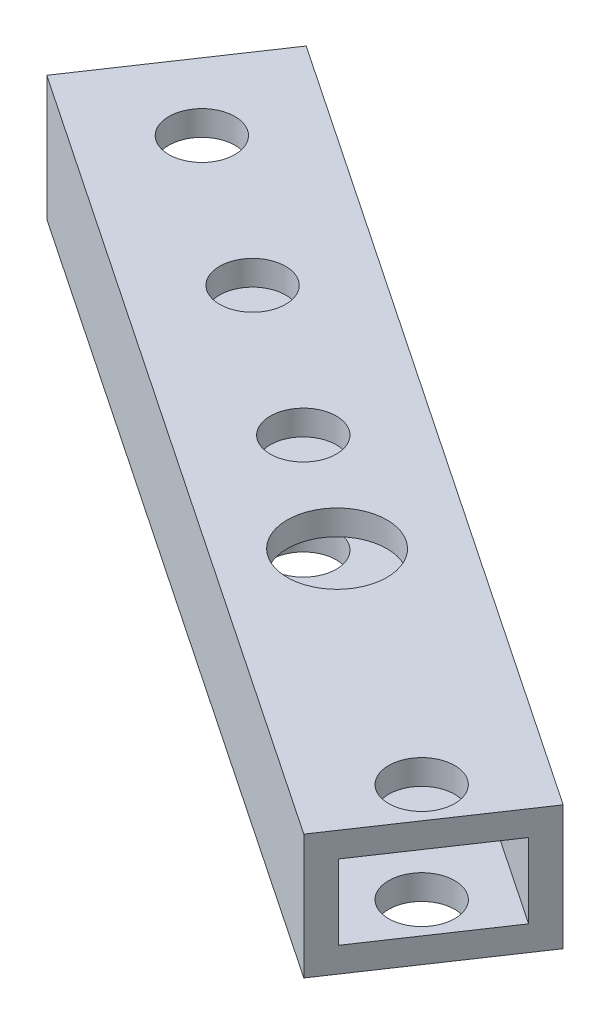
ISO-10303-21;
HEADER;
FILE_DESCRIPTION(('STEP AP214'),'2;1');
FILE_NAME('part.step','',(''),(''),'','','');
FILE_SCHEMA(('AUTOMOTIVE_DESIGN { 1 0 10303 214 1 1 1 1 }'));
ENDSEC;
DATA;
#1=APPLICATION_CONTEXT('core data for automotive mechanical design processes');
#2=APPLICATION_PROTOCOL_DEFINITION('international standard','automotive_design',2000,#1);
#3=PRODUCT_CONTEXT('',#1,'mechanical');
#4=PRODUCT('Part','Part','',(#3));
#5=PRODUCT_RELATED_PRODUCT_CATEGORY('part','',(#4));
#6=PRODUCT_DEFINITION_FORMATION('','',#4);
#7=PRODUCT_DEFINITION_CONTEXT('part definition',#1,'design');
#8=PRODUCT_DEFINITION('design','',#6,#7);
#9=PRODUCT_DEFINITION_SHAPE('','',#8);
#10=(LENGTH_UNIT() NAMED_UNIT(*) SI_UNIT(.MILLI.,.METRE.));
#11=(NAMED_UNIT(*) PLANE_ANGLE_UNIT() SI_UNIT($,.RADIAN.));
#12=(NAMED_UNIT(*) SI_UNIT($,.STERADIAN.) SOLID_ANGLE_UNIT());
#13=UNCERTAINTY_MEASURE_WITH_UNIT(LENGTH_MEASURE(1.E-05),#10,'distance_accuracy_value','');
#14=(GEOMETRIC_REPRESENTATION_CONTEXT(3) GLOBAL_UNCERTAINTY_ASSIGNED_CONTEXT((#13)) GLOBAL_UNIT_ASSIGNED_CONTEXT((#10,
#11,#12)) REPRESENTATION_CONTEXT('',''));
#15=CARTESIAN_POINT('',(0.,0.,0.));
#16=DIRECTION('',(0.,0.,1.));
#17=DIRECTION('',(1.,0.,0.));
#18=AXIS2_PLACEMENT_3D('',#15,#16,#17);
#19=CARTESIAN_POINT('',(-56.7499214691754,0.,-212.039127339994));
#20=DIRECTION('',(0.,1.,0.));
#21=DIRECTION('',(0.,0.,1.));
#22=AXIS2_PLACEMENT_3D('',#19,#20,#21);
#23=CYLINDRICAL_SURFACE('',#22,2.65);
#24=CARTESIAN_POINT('',(-56.7499214691754,12.,-212.039127339994));
#25=DIRECTION('',(0.,-1.,0.));
#26=DIRECTION('',(0.,0.,-1.));
#27=AXIS2_PLACEMENT_3D('',#24,#25,#26);
#28=CIRCLE('',#27,2.65);
#29=CARTESIAN_POINT('',(-56.7499214691754,12.,-214.689127339994));
#30=VERTEX_POINT('',#29);
#31=EDGE_CURVE('E183',#30,#30,#28,.F.);
#32=ORIENTED_EDGE('',*,*,#31,.T.);
#33=EDGE_LOOP('',(#32));
#34=FACE_BOUND('',#33,.T.);
#35=CARTESIAN_POINT('',(-56.7499214691754,10.,-212.039127339994));
#36=DIRECTION('',(0.,1.,0.));
#37=DIRECTION('',(0.,0.,1.));
#38=AXIS2_PLACEMENT_3D('',#35,#36,#37);
#39=CIRCLE('',#38,2.65);
#40=CARTESIAN_POINT('',(-56.7499214691754,10.,-209.389127339994));
#41=VERTEX_POINT('',#40);
#42=EDGE_CURVE('E136',#41,#41,#39,.T.);
#43=ORIENTED_EDGE('',*,*,#42,.F.);
#44=EDGE_LOOP('',(#43));
#45=FACE_BOUND('',#44,.T.);
#46=ADVANCED_FACE('F37',(#34,#45),#23,.F.);
#47=CARTESIAN_POINT('',(-69.1949044966264,0.,-220.413039057134));
#48=DIRECTION('',(0.,1.,0.));
#49=DIRECTION('',(0.,0.,1.));
#50=AXIS2_PLACEMENT_3D('',#47,#48,#49);
#51=CYLINDRICAL_SURFACE('',#50,2.65);
#52=CARTESIAN_POINT('',(-69.1949044966264,12.,-220.413039057134));
#53=DIRECTION('',(0.,-1.,0.));
#54=DIRECTION('',(0.,0.,-1.));
#55=AXIS2_PLACEMENT_3D('',#52,#53,#54);
#56=CIRCLE('',#55,2.65);
#57=CARTESIAN_POINT('',(-69.1949044966264,12.,-223.063039057134));
#58=VERTEX_POINT('',#57);
#59=EDGE_CURVE('E186',#58,#58,#56,.F.);
#60=ORIENTED_EDGE('',*,*,#59,.T.);
#61=EDGE_LOOP('',(#60));
#62=FACE_BOUND('',#61,.T.);
#63=CARTESIAN_POINT('',(-69.1949044966264,10.,-220.413039057134));
#64=DIRECTION('',(0.,1.,0.));
#65=DIRECTION('',(0.,0.,1.));
#66=AXIS2_PLACEMENT_3D('',#63,#64,#65);
#67=CIRCLE('',#66,2.65);
#68=CARTESIAN_POINT('',(-69.1949044966264,10.,-217.763039057134));
#69=VERTEX_POINT('',#68);
#70=EDGE_CURVE('E133',#69,#69,#67,.T.);
#71=ORIENTED_EDGE('',*,*,#70,.F.);
#72=EDGE_LOOP('',(#71));
#73=FACE_BOUND('',#72,.T.);
#74=ADVANCED_FACE('F246',(#62,#73),#51,.F.);
#75=CARTESIAN_POINT('',(-81.6398875240773,0.,-228.786950774274));
#76=DIRECTION('',(0.,1.,0.));
#77=DIRECTION('',(0.,0.,1.));
#78=AXIS2_PLACEMENT_3D('',#75,#76,#77);
#79=CYLINDRICAL_SURFACE('',#78,2.65);
#80=CARTESIAN_POINT('',(-81.6398875240773,12.,-228.786950774274));
#81=DIRECTION('',(0.,-1.,0.));
#82=DIRECTION('',(0.,0.,-1.));
#83=AXIS2_PLACEMENT_3D('',#80,#81,#82);
#84=CIRCLE('',#83,2.65);
#85=CARTESIAN_POINT('',(-81.6398875240773,12.,-231.436950774274));
#86=VERTEX_POINT('',#85);
#87=EDGE_CURVE('E189',#86,#86,#84,.F.);
#88=ORIENTED_EDGE('',*,*,#87,.T.);
#89=EDGE_LOOP('',(#88));
#90=FACE_BOUND('',#89,.T.);
#91=CARTESIAN_POINT('',(-81.6398875240773,10.,-228.786950774274));
#92=DIRECTION('',(0.,1.,0.));
#93=DIRECTION('',(0.,0.,1.));
#94=AXIS2_PLACEMENT_3D('',#91,#92,#93);
#95=CIRCLE('',#94,2.65);
#96=CARTESIAN_POINT('',(-81.6398875240773,10.,-226.136950774274));
#97=VERTEX_POINT('',#96);
#98=EDGE_CURVE('E130',#97,#97,#95,.T.);
#99=ORIENTED_EDGE('',*,*,#98,.F.);
#100=EDGE_LOOP('',(#99));
#101=FACE_BOUND('',#100,.T.);
#102=ADVANCED_FACE('F253',(#90,#101),#79,.F.);
#103=CARTESIAN_POINT('',(-27.7116277384566,0.,-192.5));
#104=DIRECTION('',(0.,1.,0.));
#105=DIRECTION('',(0.,0.,1.));
#106=AXIS2_PLACEMENT_3D('',#103,#104,#105);
#107=CYLINDRICAL_SURFACE('',#106,2.65);
#108=CARTESIAN_POINT('',(-27.7116277384566,12.,-192.5));
#109=DIRECTION('',(0.,-1.,0.));
#110=DIRECTION('',(0.,0.,-1.));
#111=AXIS2_PLACEMENT_3D('',#108,#109,#110);
#112=CIRCLE('',#111,2.65);
#113=CARTESIAN_POINT('',(-27.7116277384566,12.,-195.15));
#114=VERTEX_POINT('',#113);
#115=EDGE_CURVE('E192',#114,#114,#112,.F.);
#116=ORIENTED_EDGE('',*,*,#115,.T.);
#117=EDGE_LOOP('',(#116));
#118=FACE_BOUND('',#117,.T.);
#119=CARTESIAN_POINT('',(-27.7116277384566,10.,-192.5));
#120=DIRECTION('',(0.,1.,0.));
#121=DIRECTION('',(0.,0.,1.));
#122=AXIS2_PLACEMENT_3D('',#119,#120,#121);
#123=CIRCLE('',#122,2.65);
#124=CARTESIAN_POINT('',(-27.7116277384566,10.,-189.85));
#125=VERTEX_POINT('',#124);
#126=EDGE_CURVE('E126',#125,#125,#123,.T.);
#127=ORIENTED_EDGE('',*,*,#126,.F.);
#128=EDGE_LOOP('',(#127));
#129=FACE_BOUND('',#128,.T.);
#130=ADVANCED_FACE('F278',(#118,#129),#107,.F.);
#131=CARTESIAN_POINT('',(0.,20.,0.));
#132=DIRECTION('',(0.,1.,0.));
#133=DIRECTION('',(0.,0.,1.));
#134=AXIS2_PLACEMENT_3D('',#131,#132,#133);
#135=PLANE('',#134);
#136=CARTESIAN_POINT('',(-47.5000000000011,20.,-205.5));
#137=DIRECTION('',(0.,-1.,0.));
#138=DIRECTION('',(0.,0.,-1.));
#139=AXIS2_PLACEMENT_3D('',#136,#137,#138);
#140=CIRCLE('',#139,4.00000000000001);
#141=CARTESIAN_POINT('',(-47.5000000000011,20.,-209.5));
#142=VERTEX_POINT('',#141);
#143=EDGE_CURVE('E223',#142,#142,#140,.T.);
#144=ORIENTED_EDGE('',*,*,#143,.T.);
#145=EDGE_LOOP('',(#144));
#146=FACE_BOUND('',#145,.T.);
#147=CARTESIAN_POINT('',(-56.7499214691754,20.,-212.039127339994));
#148=DIRECTION('',(0.,1.,0.));
#149=DIRECTION('',(0.,0.,1.));
#150=AXIS2_PLACEMENT_3D('',#147,#148,#149);
#151=CIRCLE('',#150,2.65);
#152=CARTESIAN_POINT('',(-56.7499214691754,20.,-209.389127339994));
#153=VERTEX_POINT('',#152);
#154=EDGE_CURVE('E152',#153,#153,#151,.T.);
#155=ORIENTED_EDGE('',*,*,#154,.F.);
#156=EDGE_LOOP('',(#155));
#157=FACE_BOUND('',#156,.T.);
#158=CARTESIAN_POINT('',(-69.1949044966264,20.,-220.413039057134));
#159=DIRECTION('',(0.,1.,0.));
#160=DIRECTION('',(0.,0.,1.));
#161=AXIS2_PLACEMENT_3D('',#158,#159,#160);
#162=CIRCLE('',#161,2.65);
#163=CARTESIAN_POINT('',(-69.1949044966264,20.,-217.763039057134));
#164=VERTEX_POINT('',#163);
#165=EDGE_CURVE('E153',#164,#164,#162,.T.);
#166=ORIENTED_EDGE('',*,*,#165,.F.);
#167=EDGE_LOOP('',(#166));
#168=FACE_BOUND('',#167,.T.);
#169=CARTESIAN_POINT('',(-81.6398875240773,20.,-228.786950774274));
#170=DIRECTION('',(0.,1.,0.));
#171=DIRECTION('',(0.,0.,1.));
#172=AXIS2_PLACEMENT_3D('',#169,#170,#171);
#173=CIRCLE('',#172,2.65);
#174=CARTESIAN_POINT('',(-81.6398875240773,20.,-226.136950774274));
#175=VERTEX_POINT('',#174);
#176=EDGE_CURVE('E156',#175,#175,#173,.T.);
#177=ORIENTED_EDGE('',*,*,#176,.F.);
#178=EDGE_LOOP('',(#177));
#179=FACE_BOUND('',#178,.T.);
#180=CARTESIAN_POINT('',(-27.7116277384566,20.,-192.5));
#181=DIRECTION('',(0.,1.,0.));
#182=DIRECTION('',(0.,0.,1.));
#183=AXIS2_PLACEMENT_3D('',#180,#181,#182);
#184=CIRCLE('',#183,2.65);
#185=CARTESIAN_POINT('',(-27.7116277384566,20.,-189.85));
#186=VERTEX_POINT('',#185);
#187=EDGE_CURVE('E139',#186,#186,#184,.T.);
#188=ORIENTED_EDGE('',*,*,#187,.F.);
#189=EDGE_LOOP('',(#188));
#190=FACE_BOUND('',#189,.T.);
#191=DIRECTION('',(-0.829665535163396,0.,-0.55826078114268));
#192=VECTOR('',#191,1.);
#193=CARTESIAN_POINT('',(-110.52513989388,20.,-257.262887823794));
#194=LINE('',#193,#192);
#195=CARTESIAN_POINT('',(-20.6208425068146,20.,-196.768578779726));
#196=VERTEX_POINT('',#195);
#197=CARTESIAN_POINT('',(-83.6754231792327,20.,-239.19639814657));
#198=VERTEX_POINT('',#197);
#199=EDGE_CURVE('E125',#196,#198,#194,.T.);
#200=ORIENTED_EDGE('',*,*,#199,.T.);
#201=DIRECTION('',(-0.558260781142683,0.,0.829665535163394));
#202=VECTOR('',#201,1.);
#203=CARTESIAN_POINT('',(-83.6754231792327,20.,-239.19639814657));
#204=LINE('',#203,#202);
#205=CARTESIAN_POINT('',(-92.0493348963729,20.,-226.751415119119));
#206=VERTEX_POINT('',#205);
#207=EDGE_CURVE('E170',#198,#206,#204,.T.);
#208=ORIENTED_EDGE('',*,*,#207,.T.);
#209=DIRECTION('',(-0.829665535163396,0.,-0.55826078114268));
#210=VECTOR('',#209,1.);
#211=CARTESIAN_POINT('',(-111.993839361285,20.,-240.171563564712));
#212=LINE('',#211,#210);
#213=CARTESIAN_POINT('',(-28.9947542239548,20.,-184.323595752275));
#214=VERTEX_POINT('',#213);
#215=EDGE_CURVE('E143',#214,#206,#212,.T.);
#216=ORIENTED_EDGE('',*,*,#215,.F.);
#217=DIRECTION('',(0.558260781142681,0.,-0.829665535163396));
#218=VECTOR('',#217,1.);
#219=CARTESIAN_POINT('',(-28.9947542239548,20.,-184.323595752275));
#220=LINE('',#219,#218);
#221=EDGE_CURVE('E175',#214,#196,#220,.T.);
#222=ORIENTED_EDGE('',*,*,#221,.T.);
#223=EDGE_LOOP('',(#200,#208,#216,#222));
#224=FACE_BOUND('',#223,.T.);
#225=ADVANCED_FACE('F274',(#146,#157,#168,#179,#190,#224),#135,.T.);
#226=CARTESIAN_POINT('',(0.,10.,0.));
#227=DIRECTION('',(0.,1.,0.));
#228=DIRECTION('',(0.,0.,1.));
#229=AXIS2_PLACEMENT_3D('',#226,#227,#228);
#230=PLANE('',#229);
#231=CARTESIAN_POINT('',(-47.5000000000011,10.,-205.5));
#232=DIRECTION('',(0.,-1.,0.));
#233=DIRECTION('',(0.,0.,-1.));
#234=AXIS2_PLACEMENT_3D('',#231,#232,#233);
#235=CIRCLE('',#234,4.00000000000001);
#236=CARTESIAN_POINT('',(-47.5000000000011,10.,-209.5));
#237=VERTEX_POINT('',#236);
#238=EDGE_CURVE('E220',#237,#237,#235,.T.);
#239=ORIENTED_EDGE('',*,*,#238,.F.);
#240=EDGE_LOOP('',(#239));
#241=FACE_BOUND('',#240,.T.);
#242=ORIENTED_EDGE('',*,*,#42,.T.);
#243=EDGE_LOOP('',(#242));
#244=FACE_BOUND('',#243,.T.);
#245=ORIENTED_EDGE('',*,*,#70,.T.);
#246=EDGE_LOOP('',(#245));
#247=FACE_BOUND('',#246,.T.);
#248=ORIENTED_EDGE('',*,*,#98,.T.);
#249=EDGE_LOOP('',(#248));
#250=FACE_BOUND('',#249,.T.);
#251=ORIENTED_EDGE('',*,*,#126,.T.);
#252=EDGE_LOOP('',(#251));
#253=FACE_BOUND('',#252,.T.);
#254=DIRECTION('',(-0.558260781142683,0.,0.829665535163394));
#255=VECTOR('',#254,1.);
#256=CARTESIAN_POINT('',(-168.386081906795,10.,-113.302700467521));
#257=LINE('',#256,#255);
#258=CARTESIAN_POINT('',(-83.6754231792327,10.,-239.19639814657));
#259=VERTEX_POINT('',#258);
#260=CARTESIAN_POINT('',(-92.0493348963729,10.,-226.751415119119));
#261=VERTEX_POINT('',#260);
#262=EDGE_CURVE('E164',#259,#261,#257,.T.);
#263=ORIENTED_EDGE('',*,*,#262,.F.);
#264=DIRECTION('',(-0.829665535163396,0.,-0.55826078114268));
#265=VECTOR('',#264,1.);
#266=CARTESIAN_POINT('',(-110.52513989388,10.,-257.262887823794));
#267=LINE('',#266,#265);
#268=CARTESIAN_POINT('',(-20.6208425068146,10.,-196.768578779726));
#269=VERTEX_POINT('',#268);
#270=EDGE_CURVE('E140',#269,#259,#267,.T.);
#271=ORIENTED_EDGE('',*,*,#270,.F.);
#272=DIRECTION('',(0.558260781142681,0.,-0.829665535163396));
#273=VECTOR('',#272,1.);
#274=CARTESIAN_POINT('',(-105.331501234377,10.,-70.8748811006762));
#275=LINE('',#274,#273);
#276=CARTESIAN_POINT('',(-28.9947542239548,10.,-184.323595752275));
#277=VERTEX_POINT('',#276);
#278=EDGE_CURVE('E161',#277,#269,#275,.T.);
#279=ORIENTED_EDGE('',*,*,#278,.F.);
#280=DIRECTION('',(-0.829665535163396,0.,-0.55826078114268));
#281=VECTOR('',#280,1.);
#282=CARTESIAN_POINT('',(-111.993839361285,10.,-240.171563564712));
#283=LINE('',#282,#281);
#284=EDGE_CURVE('E129',#277,#261,#283,.T.);
#285=ORIENTED_EDGE('',*,*,#284,.T.);
#286=EDGE_LOOP('',(#263,#271,#279,#285));
#287=FACE_BOUND('',#286,.T.);
#288=ADVANCED_FACE('F277',(#241,#244,#247,#250,#253,#287),#230,.F.);
#289=CARTESIAN_POINT('',(-110.52513989388,20.,-257.262887823794));
#290=DIRECTION('',(-0.55826078114268,0.,0.829665535163396));
#291=DIRECTION('',(0.829665535163396,0.,0.55826078114268));
#292=AXIS2_PLACEMENT_3D('',#289,#290,#291);
#293=PLANE('',#292);
#294=DIRECTION('',(0.,1.,0.));
#295=VECTOR('',#294,1.);
#296=CARTESIAN_POINT('',(-83.6754231792327,0.,-239.19639814657));
#297=LINE('',#296,#295);
#298=EDGE_CURVE('E166',#259,#198,#297,.T.);
#299=ORIENTED_EDGE('',*,*,#298,.T.);
#300=ORIENTED_EDGE('',*,*,#199,.F.);
#301=DIRECTION('',(0.,1.,0.));
#302=VECTOR('',#301,1.);
#303=CARTESIAN_POINT('',(-20.6208425068146,0.,-196.768578779726));
#304=LINE('',#303,#302);
#305=EDGE_CURVE('E167',#269,#196,#304,.T.);
#306=ORIENTED_EDGE('',*,*,#305,.F.);
#307=ORIENTED_EDGE('',*,*,#270,.T.);
#308=EDGE_LOOP('',(#299,#300,#306,#307));
#309=FACE_BOUND('',#308,.T.);
#310=ADVANCED_FACE('F39',(#309),#293,.F.);
#311=CARTESIAN_POINT('',(-111.993839361285,20.,-240.171563564712));
#312=DIRECTION('',(-0.55826078114268,0.,0.829665535163396));
#313=DIRECTION('',(0.829665535163396,0.,0.55826078114268));
#314=AXIS2_PLACEMENT_3D('',#311,#312,#313);
#315=PLANE('',#314);
#316=ORIENTED_EDGE('',*,*,#215,.T.);
#317=DIRECTION('',(0.,-1.,0.));
#318=VECTOR('',#317,1.);
#319=CARTESIAN_POINT('',(-92.0493348963729,20.,-226.751415119119));
#320=LINE('',#319,#318);
#321=EDGE_CURVE('E106',#206,#261,#320,.T.);
#322=ORIENTED_EDGE('',*,*,#321,.T.);
#323=ORIENTED_EDGE('',*,*,#284,.F.);
#324=DIRECTION('',(0.,1.,0.));
#325=VECTOR('',#324,1.);
#326=CARTESIAN_POINT('',(-28.9947542239548,8.39057923106015,-184.323595752275));
#327=LINE('',#326,#325);
#328=EDGE_CURVE('E178',#277,#214,#327,.T.);
#329=ORIENTED_EDGE('',*,*,#328,.T.);
#330=EDGE_LOOP('',(#316,#322,#323,#329));
#331=FACE_BOUND('',#330,.T.);
#332=ADVANCED_FACE('F260',(#331),#315,.T.);
#333=CARTESIAN_POINT('',(-56.7499214691754,18.,-212.039127339994));
#334=DIRECTION('',(0.,1.,0.));
#335=DIRECTION('',(0.,0.,1.));
#336=AXIS2_PLACEMENT_3D('',#333,#334,#335);
#337=CIRCLE('',#336,2.65);
#338=CARTESIAN_POINT('',(-56.7499214691754,18.,-209.389127339994));
#339=VERTEX_POINT('',#338);
#340=EDGE_CURVE('E198',#339,#339,#337,.F.);
#341=ORIENTED_EDGE('',*,*,#340,.T.);
#342=EDGE_LOOP('',(#341));
#343=FACE_BOUND('',#342,.T.);
#344=ORIENTED_EDGE('',*,*,#154,.T.);
#345=EDGE_LOOP('',(#344));
#346=FACE_BOUND('',#345,.T.);
#347=ADVANCED_FACE('F249',(#343,#346),#23,.F.);
#348=CARTESIAN_POINT('',(-69.1949044966264,18.,-220.413039057134));
#349=DIRECTION('',(0.,1.,0.));
#350=DIRECTION('',(0.,0.,1.));
#351=AXIS2_PLACEMENT_3D('',#348,#349,#350);
#352=CIRCLE('',#351,2.65);
#353=CARTESIAN_POINT('',(-69.1949044966264,18.,-217.763039057134));
#354=VERTEX_POINT('',#353);
#355=EDGE_CURVE('E201',#354,#354,#352,.F.);
#356=ORIENTED_EDGE('',*,*,#355,.T.);
#357=EDGE_LOOP('',(#356));
#358=FACE_BOUND('',#357,.T.);
#359=ORIENTED_EDGE('',*,*,#165,.T.);
#360=EDGE_LOOP('',(#359));
#361=FACE_BOUND('',#360,.T.);
#362=ADVANCED_FACE('F256',(#358,#361),#51,.F.);
#363=CARTESIAN_POINT('',(-81.6398875240773,18.,-228.786950774274));
#364=DIRECTION('',(0.,1.,0.));
#365=DIRECTION('',(0.,0.,1.));
#366=AXIS2_PLACEMENT_3D('',#363,#364,#365);
#367=CIRCLE('',#366,2.65);
#368=CARTESIAN_POINT('',(-81.6398875240773,18.,-226.136950774274));
#369=VERTEX_POINT('',#368);
#370=EDGE_CURVE('E204',#369,#369,#367,.F.);
#371=ORIENTED_EDGE('',*,*,#370,.T.);
#372=EDGE_LOOP('',(#371));
#373=FACE_BOUND('',#372,.T.);
#374=ORIENTED_EDGE('',*,*,#176,.T.);
#375=EDGE_LOOP('',(#374));
#376=FACE_BOUND('',#375,.T.);
#377=ADVANCED_FACE('F266',(#373,#376),#79,.F.);
#378=CARTESIAN_POINT('',(-27.7116277384566,18.,-192.5));
#379=DIRECTION('',(0.,1.,0.));
#380=DIRECTION('',(0.,0.,1.));
#381=AXIS2_PLACEMENT_3D('',#378,#379,#380);
#382=CIRCLE('',#381,2.65);
#383=CARTESIAN_POINT('',(-27.7116277384566,18.,-189.85));
#384=VERTEX_POINT('',#383);
#385=EDGE_CURVE('E207',#384,#384,#382,.F.);
#386=ORIENTED_EDGE('',*,*,#385,.T.);
#387=EDGE_LOOP('',(#386));
#388=FACE_BOUND('',#387,.T.);
#389=ORIENTED_EDGE('',*,*,#187,.T.);
#390=EDGE_LOOP('',(#389));
#391=FACE_BOUND('',#390,.T.);
#392=ADVANCED_FACE('F296',(#388,#391),#107,.F.);
#393=CARTESIAN_POINT('',(-83.6754231792327,0.,-239.19639814657));
#394=DIRECTION('',(-0.829665535163394,0.,-0.558260781142683));
#395=DIRECTION('',(-0.558260781142683,0.,0.829665535163394));
#396=AXIS2_PLACEMENT_3D('',#393,#394,#395);
#397=PLANE('',#396);
#398=DIRECTION('',(0.,-1.,0.));
#399=VECTOR('',#398,1.);
#400=CARTESIAN_POINT('',(-84.791944741518,0.,-237.537067076243));
#401=LINE('',#400,#399);
#402=CARTESIAN_POINT('',(-84.791944741518,18.,-237.537067076243));
#403=VERTEX_POINT('',#402);
#404=CARTESIAN_POINT('',(-84.791944741518,12.,-237.537067076243));
#405=VERTEX_POINT('',#404);
#406=EDGE_CURVE('E181',#403,#405,#401,.T.);
#407=ORIENTED_EDGE('',*,*,#406,.F.);
#408=DIRECTION('',(0.558260781142683,0.,-0.829665535163394));
#409=VECTOR('',#408,1.);
#410=CARTESIAN_POINT('',(-83.6754231792327,18.,-239.19639814657));
#411=LINE('',#410,#409);
#412=CARTESIAN_POINT('',(-90.9328133340875,18.,-228.410746189446));
#413=VERTEX_POINT('',#412);
#414=EDGE_CURVE('E210',#413,#403,#411,.T.);
#415=ORIENTED_EDGE('',*,*,#414,.F.);
#416=DIRECTION('',(0.,1.,0.));
#417=VECTOR('',#416,1.);
#418=CARTESIAN_POINT('',(-90.9328133340875,0.,-228.410746189446));
#419=LINE('',#418,#417);
#420=CARTESIAN_POINT('',(-90.9328133340875,12.,-228.410746189446));
#421=VERTEX_POINT('',#420);
#422=EDGE_CURVE('E113',#421,#413,#419,.T.);
#423=ORIENTED_EDGE('',*,*,#422,.F.);
#424=DIRECTION('',(-0.558260781142683,0.,0.829665535163394));
#425=VECTOR('',#424,1.);
#426=CARTESIAN_POINT('',(-83.6754231792327,12.,-239.19639814657));
#427=LINE('',#426,#425);
#428=EDGE_CURVE('E195',#405,#421,#427,.T.);
#429=ORIENTED_EDGE('',*,*,#428,.F.);
#430=EDGE_LOOP('',(#407,#415,#423,#429));
#431=FACE_BOUND('',#430,.T.);
#432=ORIENTED_EDGE('',*,*,#262,.T.);
#433=ORIENTED_EDGE('',*,*,#321,.F.);
#434=ORIENTED_EDGE('',*,*,#207,.F.);
#435=ORIENTED_EDGE('',*,*,#298,.F.);
#436=EDGE_LOOP('',(#432,#433,#434,#435));
#437=FACE_BOUND('',#436,.T.);
#438=ADVANCED_FACE('F294',(#431,#437),#397,.T.);
#439=CARTESIAN_POINT('',(-28.9947542239548,0.,-184.323595752275));
#440=DIRECTION('',(0.829665535163396,0.,0.558260781142681));
#441=DIRECTION('',(0.558260781142681,0.,-0.829665535163396));
#442=AXIS2_PLACEMENT_3D('',#439,#440,#441);
#443=PLANE('',#442);
#444=DIRECTION('',(0.,1.,0.));
#445=VECTOR('',#444,1.);
#446=CARTESIAN_POINT('',(-21.7373640691,0.,-195.109247709399));
#447=LINE('',#446,#445);
#448=CARTESIAN_POINT('',(-21.7373640691,12.,-195.109247709399));
#449=VERTEX_POINT('',#448);
#450=CARTESIAN_POINT('',(-21.7373640691,18.,-195.109247709399));
#451=VERTEX_POINT('',#450);
#452=EDGE_CURVE('E12',#449,#451,#447,.T.);
#453=ORIENTED_EDGE('',*,*,#452,.F.);
#454=DIRECTION('',(0.558260781142681,0.,-0.829665535163396));
#455=VECTOR('',#454,1.);
#456=CARTESIAN_POINT('',(-28.9947542239548,12.,-184.323595752275));
#457=LINE('',#456,#455);
#458=CARTESIAN_POINT('',(-27.8782326616694,12.,-185.982926822602));
#459=VERTEX_POINT('',#458);
#460=EDGE_CURVE('E46',#459,#449,#457,.T.);
#461=ORIENTED_EDGE('',*,*,#460,.F.);
#462=DIRECTION('',(0.,-1.,0.));
#463=VECTOR('',#462,1.);
#464=CARTESIAN_POINT('',(-27.8782326616695,0.,-185.982926822602));
#465=LINE('',#464,#463);
#466=CARTESIAN_POINT('',(-27.8782326616695,18.,-185.982926822602));
#467=VERTEX_POINT('',#466);
#468=EDGE_CURVE('E105',#467,#459,#465,.T.);
#469=ORIENTED_EDGE('',*,*,#468,.F.);
#470=DIRECTION('',(-0.558260781142681,0.,0.829665535163396));
#471=VECTOR('',#470,1.);
#472=CARTESIAN_POINT('',(-28.9947542239548,18.,-184.323595752275));
#473=LINE('',#472,#471);
#474=EDGE_CURVE('E99',#451,#467,#473,.T.);
#475=ORIENTED_EDGE('',*,*,#474,.F.);
#476=EDGE_LOOP('',(#453,#461,#469,#475));
#477=FACE_BOUND('',#476,.T.);
#478=ORIENTED_EDGE('',*,*,#278,.T.);
#479=ORIENTED_EDGE('',*,*,#305,.T.);
#480=ORIENTED_EDGE('',*,*,#221,.F.);
#481=ORIENTED_EDGE('',*,*,#328,.F.);
#482=EDGE_LOOP('',(#478,#479,#480,#481));
#483=FACE_BOUND('',#482,.T.);
#484=ADVANCED_FACE('F118',(#477,#483),#443,.T.);
#485=CARTESIAN_POINT('',(-239.213254673289,12.,-328.184873837042));
#486=DIRECTION('',(0.,-1.,0.));
#487=DIRECTION('',(0.,0.,-1.));
#488=AXIS2_PLACEMENT_3D('',#485,#486,#487);
#489=PLANE('',#488);
#490=CARTESIAN_POINT('',(-47.5000000000011,12.,-205.5));
#491=DIRECTION('',(0.,-1.,0.));
#492=DIRECTION('',(0.,0.,-1.));
#493=AXIS2_PLACEMENT_3D('',#490,#491,#492);
#494=CIRCLE('',#493,4.00000000000001);
#495=CARTESIAN_POINT('',(-47.5000000000011,12.,-209.5));
#496=VERTEX_POINT('',#495);
#497=EDGE_CURVE('E213',#496,#496,#494,.T.);
#498=ORIENTED_EDGE('',*,*,#497,.T.);
#499=EDGE_LOOP('',(#498));
#500=FACE_BOUND('',#499,.T.);
#501=ORIENTED_EDGE('',*,*,#59,.F.);
#502=EDGE_LOOP('',(#501));
#503=FACE_BOUND('',#502,.T.);
#504=ORIENTED_EDGE('',*,*,#115,.F.);
#505=EDGE_LOOP('',(#504));
#506=FACE_BOUND('',#505,.T.);
#507=ORIENTED_EDGE('',*,*,#428,.T.);
#508=DIRECTION('',(0.829665535163396,0.,0.558260781142681));
#509=VECTOR('',#508,1.);
#510=CARTESIAN_POINT('',(-239.213254673289,12.,-328.184873837042));
#511=LINE('',#510,#509);
#512=EDGE_CURVE('E115',#421,#459,#511,.T.);
#513=ORIENTED_EDGE('',*,*,#512,.T.);
#514=ORIENTED_EDGE('',*,*,#460,.T.);
#515=DIRECTION('',(0.829665535163396,0.,0.558260781142681));
#516=VECTOR('',#515,1.);
#517=CARTESIAN_POINT('',(-233.072386080719,12.,-337.311194723839));
#518=LINE('',#517,#516);
#519=EDGE_CURVE('E212',#405,#449,#518,.T.);
#520=ORIENTED_EDGE('',*,*,#519,.F.);
#521=EDGE_LOOP('',(#507,#513,#514,#520));
#522=FACE_BOUND('',#521,.T.);
#523=ORIENTED_EDGE('',*,*,#87,.F.);
#524=EDGE_LOOP('',(#523));
#525=FACE_BOUND('',#524,.T.);
#526=ORIENTED_EDGE('',*,*,#31,.F.);
#527=EDGE_LOOP('',(#526));
#528=FACE_BOUND('',#527,.T.);
#529=ADVANCED_FACE('F303',(#500,#503,#506,#522,#525,#528),#489,.F.);
#530=CARTESIAN_POINT('',(-239.213254673289,18.,-328.184873837042));
#531=DIRECTION('',(0.,1.,0.));
#532=DIRECTION('',(0.,0.,1.));
#533=AXIS2_PLACEMENT_3D('',#530,#531,#532);
#534=PLANE('',#533);
#535=CARTESIAN_POINT('',(-47.5000000000011,18.,-205.5));
#536=DIRECTION('',(0.,1.,0.));
#537=DIRECTION('',(0.,0.,1.));
#538=AXIS2_PLACEMENT_3D('',#535,#536,#537);
#539=CIRCLE('',#538,4.00000000000001);
#540=CARTESIAN_POINT('',(-47.5000000000011,18.,-201.5));
#541=VERTEX_POINT('',#540);
#542=EDGE_CURVE('E41',#541,#541,#539,.T.);
#543=ORIENTED_EDGE('',*,*,#542,.T.);
#544=EDGE_LOOP('',(#543));
#545=FACE_BOUND('',#544,.T.);
#546=ORIENTED_EDGE('',*,*,#355,.F.);
#547=EDGE_LOOP('',(#546));
#548=FACE_BOUND('',#547,.T.);
#549=ORIENTED_EDGE('',*,*,#385,.F.);
#550=EDGE_LOOP('',(#549));
#551=FACE_BOUND('',#550,.T.);
#552=ORIENTED_EDGE('',*,*,#414,.T.);
#553=DIRECTION('',(0.829665535163396,0.,0.558260781142681));
#554=VECTOR('',#553,1.);
#555=CARTESIAN_POINT('',(-233.072386080719,18.,-337.311194723839));
#556=LINE('',#555,#554);
#557=EDGE_CURVE('E58',#403,#451,#556,.T.);
#558=ORIENTED_EDGE('',*,*,#557,.T.);
#559=ORIENTED_EDGE('',*,*,#474,.T.);
#560=DIRECTION('',(0.829665535163396,0.,0.558260781142681));
#561=VECTOR('',#560,1.);
#562=CARTESIAN_POINT('',(-239.213254673289,18.,-328.184873837042));
#563=LINE('',#562,#561);
#564=EDGE_CURVE('E53',#413,#467,#563,.T.);
#565=ORIENTED_EDGE('',*,*,#564,.F.);
#566=EDGE_LOOP('',(#552,#558,#559,#565));
#567=FACE_BOUND('',#566,.T.);
#568=ORIENTED_EDGE('',*,*,#370,.F.);
#569=EDGE_LOOP('',(#568));
#570=FACE_BOUND('',#569,.T.);
#571=ORIENTED_EDGE('',*,*,#340,.F.);
#572=EDGE_LOOP('',(#571));
#573=FACE_BOUND('',#572,.T.);
#574=ADVANCED_FACE('F100',(#545,#548,#551,#567,#570,#573),#534,.F.);
#575=CARTESIAN_POINT('',(-233.072386080719,12.,-337.311194723839));
#576=DIRECTION('',(0.558260781142681,0.,-0.829665535163396));
#577=DIRECTION('',(-0.829665535163396,0.,-0.558260781142681));
#578=AXIS2_PLACEMENT_3D('',#575,#576,#577);
#579=PLANE('',#578);
#580=ORIENTED_EDGE('',*,*,#406,.T.);
#581=ORIENTED_EDGE('',*,*,#519,.T.);
#582=ORIENTED_EDGE('',*,*,#452,.T.);
#583=ORIENTED_EDGE('',*,*,#557,.F.);
#584=EDGE_LOOP('',(#580,#581,#582,#583));
#585=FACE_BOUND('',#584,.T.);
#586=ADVANCED_FACE('F242',(#585),#579,.F.);
#587=CARTESIAN_POINT('',(-239.213254673289,12.,-328.184873837042));
#588=DIRECTION('',(-0.558260781142681,0.,0.829665535163396));
#589=DIRECTION('',(0.829665535163396,0.,0.558260781142681));
#590=AXIS2_PLACEMENT_3D('',#587,#588,#589);
#591=PLANE('',#590);
#592=ORIENTED_EDGE('',*,*,#422,.T.);
#593=ORIENTED_EDGE('',*,*,#564,.T.);
#594=ORIENTED_EDGE('',*,*,#468,.T.);
#595=ORIENTED_EDGE('',*,*,#512,.F.);
#596=EDGE_LOOP('',(#592,#593,#594,#595));
#597=FACE_BOUND('',#596,.T.);
#598=ADVANCED_FACE('F109',(#597),#591,.F.);
#599=CARTESIAN_POINT('',(-47.5000000000011,20.,-205.5));
#600=DIRECTION('',(0.,-1.,0.));
#601=DIRECTION('',(0.,0.,-1.));
#602=AXIS2_PLACEMENT_3D('',#599,#600,#601);
#603=CYLINDRICAL_SURFACE('',#602,4.00000000000001);
#604=ORIENTED_EDGE('',*,*,#143,.F.);
#605=EDGE_LOOP('',(#604));
#606=FACE_BOUND('',#605,.T.);
#607=ORIENTED_EDGE('',*,*,#542,.F.);
#608=EDGE_LOOP('',(#607));
#609=FACE_BOUND('',#608,.T.);
#610=ADVANCED_FACE('F232',(#606,#609),#603,.F.);
#611=ORIENTED_EDGE('',*,*,#238,.T.);
#612=EDGE_LOOP('',(#611));
#613=FACE_BOUND('',#612,.T.);
#614=ORIENTED_EDGE('',*,*,#497,.F.);
#615=EDGE_LOOP('',(#614));
#616=FACE_BOUND('',#615,.T.);
#617=ADVANCED_FACE('F234',(#613,#616),#603,.F.);
#618=CLOSED_SHELL('',(#46,#74,#102,#130,#225,#288,#310,#332,#347,#362,#377,#392,#438,#484,#529,
#574,#586,#598,#610,#617));
#619=MANIFOLD_SOLID_BREP('B2',#618);
#620=ADVANCED_BREP_SHAPE_REPRESENTATION('',(#18,#619),#14);
#621=SHAPE_DEFINITION_REPRESENTATION(#9,#620);
ENDSEC;
END-ISO-10303-21;
